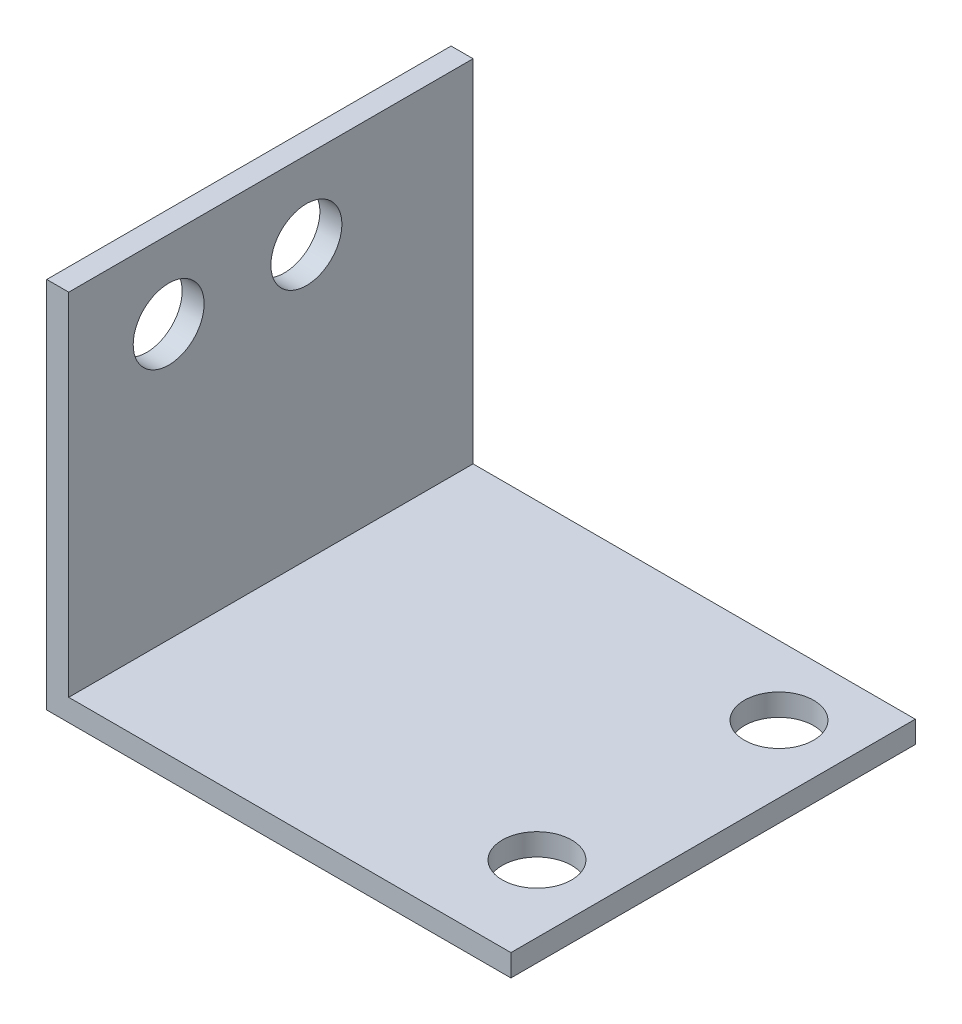
ISO-10303-21;
HEADER;
FILE_DESCRIPTION(('STEP AP214'),'2;1');
FILE_NAME('part.step','',(''),(''),'','','');
FILE_SCHEMA(('AUTOMOTIVE_DESIGN { 1 0 10303 214 1 1 1 1 }'));
ENDSEC;
DATA;
#1=APPLICATION_CONTEXT('core data for automotive mechanical design processes');
#2=APPLICATION_PROTOCOL_DEFINITION('international standard','automotive_design',2000,#1);
#3=PRODUCT_CONTEXT('',#1,'mechanical');
#4=PRODUCT('Part','Part','',(#3));
#5=PRODUCT_RELATED_PRODUCT_CATEGORY('part','',(#4));
#6=PRODUCT_DEFINITION_FORMATION('','',#4);
#7=PRODUCT_DEFINITION_CONTEXT('part definition',#1,'design');
#8=PRODUCT_DEFINITION('design','',#6,#7);
#9=PRODUCT_DEFINITION_SHAPE('','',#8);
#10=(LENGTH_UNIT() NAMED_UNIT(*) SI_UNIT(.MILLI.,.METRE.));
#11=(NAMED_UNIT(*) PLANE_ANGLE_UNIT() SI_UNIT($,.RADIAN.));
#12=(NAMED_UNIT(*) SI_UNIT($,.STERADIAN.) SOLID_ANGLE_UNIT());
#13=UNCERTAINTY_MEASURE_WITH_UNIT(LENGTH_MEASURE(1.E-05),#10,'distance_accuracy_value','');
#14=(GEOMETRIC_REPRESENTATION_CONTEXT(3) GLOBAL_UNCERTAINTY_ASSIGNED_CONTEXT((#13)) GLOBAL_UNIT_ASSIGNED_CONTEXT((#10,
#11,#12)) REPRESENTATION_CONTEXT('',''));
#15=CARTESIAN_POINT('',(0.,0.,0.));
#16=DIRECTION('',(0.,0.,1.));
#17=DIRECTION('',(1.,0.,0.));
#18=AXIS2_PLACEMENT_3D('',#15,#16,#17);
#19=CARTESIAN_POINT('',(0.,2.,0.));
#20=DIRECTION('',(0.,1.,0.));
#21=DIRECTION('',(0.,0.,1.));
#22=AXIS2_PLACEMENT_3D('',#19,#20,#21);
#23=PLANE('',#22);
#24=DIRECTION('',(0.,0.,-1.));
#25=VECTOR('',#24,1.);
#26=CARTESIAN_POINT('',(-19.1,2.,0.));
#27=LINE('',#26,#25);
#28=CARTESIAN_POINT('',(-19.1,2.,18.38));
#29=VERTEX_POINT('',#28);
#30=CARTESIAN_POINT('',(-19.1,2.,-18.38));
#31=VERTEX_POINT('',#30);
#32=EDGE_CURVE('E51',#29,#31,#27,.T.);
#33=ORIENTED_EDGE('',*,*,#32,.F.);
#34=DIRECTION('',(1.,0.,0.));
#35=VECTOR('',#34,1.);
#36=CARTESIAN_POINT('',(-21.1,2.,18.38));
#37=LINE('',#36,#35);
#38=CARTESIAN_POINT('',(21.1,2.,18.38));
#39=VERTEX_POINT('',#38);
#40=EDGE_CURVE('E90',#29,#39,#37,.T.);
#41=ORIENTED_EDGE('',*,*,#40,.T.);
#42=DIRECTION('',(0.,0.,-1.));
#43=VECTOR('',#42,1.);
#44=CARTESIAN_POINT('',(21.1,2.,-18.38));
#45=LINE('',#44,#43);
#46=CARTESIAN_POINT('',(21.1,2.,-18.38));
#47=VERTEX_POINT('',#46);
#48=EDGE_CURVE('E127',#39,#47,#45,.T.);
#49=ORIENTED_EDGE('',*,*,#48,.T.);
#50=DIRECTION('',(-1.,0.,0.));
#51=VECTOR('',#50,1.);
#52=CARTESIAN_POINT('',(-21.1,2.,-18.38));
#53=LINE('',#52,#51);
#54=EDGE_CURVE('E47',#47,#31,#53,.T.);
#55=ORIENTED_EDGE('',*,*,#54,.T.);
#56=EDGE_LOOP('',(#33,#41,#49,#55));
#57=FACE_BOUND('',#56,.T.);
#58=CARTESIAN_POINT('',(14.99,2.,-12.1));
#59=DIRECTION('',(0.,1.,0.));
#60=DIRECTION('',(0.,0.,1.));
#61=AXIS2_PLACEMENT_3D('',#58,#59,#60);
#62=CIRCLE('',#61,3.15);
#63=CARTESIAN_POINT('',(14.99,2.,-8.95));
#64=VERTEX_POINT('',#63);
#65=EDGE_CURVE('E121',#64,#64,#62,.T.);
#66=ORIENTED_EDGE('',*,*,#65,.F.);
#67=EDGE_LOOP('',(#66));
#68=FACE_BOUND('',#67,.T.);
#69=CARTESIAN_POINT('',(14.99,2.,9.9));
#70=DIRECTION('',(0.,1.,0.));
#71=DIRECTION('',(0.,0.,1.));
#72=AXIS2_PLACEMENT_3D('',#69,#70,#71);
#73=CIRCLE('',#72,3.15);
#74=CARTESIAN_POINT('',(14.99,2.,13.05));
#75=VERTEX_POINT('',#74);
#76=EDGE_CURVE('E115',#75,#75,#73,.T.);
#77=ORIENTED_EDGE('',*,*,#76,.F.);
#78=EDGE_LOOP('',(#77));
#79=FACE_BOUND('',#78,.T.);
#80=ADVANCED_FACE('F32',(#57,#68,#79),#23,.T.);
#81=CARTESIAN_POINT('',(0.,0.,0.));
#82=DIRECTION('',(0.,1.,0.));
#83=DIRECTION('',(0.,0.,1.));
#84=AXIS2_PLACEMENT_3D('',#81,#82,#83);
#85=PLANE('',#84);
#86=CARTESIAN_POINT('',(14.99,0.,-12.1));
#87=DIRECTION('',(0.,1.,0.));
#88=DIRECTION('',(0.,0.,1.));
#89=AXIS2_PLACEMENT_3D('',#86,#87,#88);
#90=CIRCLE('',#89,3.15);
#91=CARTESIAN_POINT('',(14.99,0.,-8.95));
#92=VERTEX_POINT('',#91);
#93=EDGE_CURVE('E118',#92,#92,#90,.T.);
#94=ORIENTED_EDGE('',*,*,#93,.T.);
#95=EDGE_LOOP('',(#94));
#96=FACE_BOUND('',#95,.T.);
#97=DIRECTION('',(0.,0.,-1.));
#98=VECTOR('',#97,1.);
#99=CARTESIAN_POINT('',(21.1,0.,-18.38));
#100=LINE('',#99,#98);
#101=CARTESIAN_POINT('',(21.1,0.,18.38));
#102=VERTEX_POINT('',#101);
#103=CARTESIAN_POINT('',(21.1,0.,-18.38));
#104=VERTEX_POINT('',#103);
#105=EDGE_CURVE('E124',#102,#104,#100,.T.);
#106=ORIENTED_EDGE('',*,*,#105,.F.);
#107=DIRECTION('',(1.,0.,0.));
#108=VECTOR('',#107,1.);
#109=CARTESIAN_POINT('',(-21.1,0.,18.38));
#110=LINE('',#109,#108);
#111=CARTESIAN_POINT('',(-21.1,0.,18.38));
#112=VERTEX_POINT('',#111);
#113=EDGE_CURVE('E129',#112,#102,#110,.T.);
#114=ORIENTED_EDGE('',*,*,#113,.F.);
#115=DIRECTION('',(0.,0.,1.));
#116=VECTOR('',#115,1.);
#117=CARTESIAN_POINT('',(-21.1,0.,-18.38));
#118=LINE('',#117,#116);
#119=CARTESIAN_POINT('',(-21.1,0.,-18.38));
#120=VERTEX_POINT('',#119);
#121=EDGE_CURVE('E137',#120,#112,#118,.T.);
#122=ORIENTED_EDGE('',*,*,#121,.F.);
#123=DIRECTION('',(-1.,0.,0.));
#124=VECTOR('',#123,1.);
#125=CARTESIAN_POINT('',(-21.1,0.,-18.38));
#126=LINE('',#125,#124);
#127=EDGE_CURVE('E135',#104,#120,#126,.T.);
#128=ORIENTED_EDGE('',*,*,#127,.F.);
#129=EDGE_LOOP('',(#106,#114,#122,#128));
#130=FACE_BOUND('',#129,.T.);
#131=CARTESIAN_POINT('',(14.99,0.,9.9));
#132=DIRECTION('',(0.,1.,0.));
#133=DIRECTION('',(0.,0.,1.));
#134=AXIS2_PLACEMENT_3D('',#131,#132,#133);
#135=CIRCLE('',#134,3.15);
#136=CARTESIAN_POINT('',(14.99,0.,13.05));
#137=VERTEX_POINT('',#136);
#138=EDGE_CURVE('E114',#137,#137,#135,.T.);
#139=ORIENTED_EDGE('',*,*,#138,.T.);
#140=EDGE_LOOP('',(#139));
#141=FACE_BOUND('',#140,.T.);
#142=ADVANCED_FACE('F152',(#96,#130,#141),#85,.F.);
#143=CARTESIAN_POINT('',(21.1,2.,-18.38));
#144=DIRECTION('',(-1.,0.,0.));
#145=DIRECTION('',(0.,0.,1.));
#146=AXIS2_PLACEMENT_3D('',#143,#144,#145);
#147=PLANE('',#146);
#148=ORIENTED_EDGE('',*,*,#105,.T.);
#149=DIRECTION('',(0.,-1.,0.));
#150=VECTOR('',#149,1.);
#151=CARTESIAN_POINT('',(21.1,2.,-18.38));
#152=LINE('',#151,#150);
#153=EDGE_CURVE('E11',#47,#104,#152,.T.);
#154=ORIENTED_EDGE('',*,*,#153,.F.);
#155=ORIENTED_EDGE('',*,*,#48,.F.);
#156=DIRECTION('',(0.,-1.,0.));
#157=VECTOR('',#156,1.);
#158=CARTESIAN_POINT('',(21.1,2.,18.38));
#159=LINE('',#158,#157);
#160=EDGE_CURVE('E132',#39,#102,#159,.T.);
#161=ORIENTED_EDGE('',*,*,#160,.T.);
#162=EDGE_LOOP('',(#148,#154,#155,#161));
#163=FACE_BOUND('',#162,.T.);
#164=ADVANCED_FACE('F34',(#163),#147,.F.);
#165=CARTESIAN_POINT('',(-21.1,2.,-18.38));
#166=DIRECTION('',(0.,0.,1.));
#167=DIRECTION('',(1.,0.,0.));
#168=AXIS2_PLACEMENT_3D('',#165,#166,#167);
#169=PLANE('',#168);
#170=ORIENTED_EDGE('',*,*,#127,.T.);
#171=DIRECTION('',(0.,-1.,0.));
#172=VECTOR('',#171,1.);
#173=CARTESIAN_POINT('',(-21.1,2.,-18.38));
#174=LINE('',#173,#172);
#175=CARTESIAN_POINT('',(-21.1,33.9,-18.38));
#176=VERTEX_POINT('',#175);
#177=EDGE_CURVE('E40',#176,#120,#174,.T.);
#178=ORIENTED_EDGE('',*,*,#177,.F.);
#179=DIRECTION('',(-1.,0.,0.));
#180=VECTOR('',#179,1.);
#181=CARTESIAN_POINT('',(-19.1,33.9,-18.38));
#182=LINE('',#181,#180);
#183=CARTESIAN_POINT('',(-19.1,33.9,-18.38));
#184=VERTEX_POINT('',#183);
#185=EDGE_CURVE('E102',#184,#176,#182,.T.);
#186=ORIENTED_EDGE('',*,*,#185,.F.);
#187=DIRECTION('',(0.,-1.,0.));
#188=VECTOR('',#187,1.);
#189=CARTESIAN_POINT('',(-19.1,0.,-18.38));
#190=LINE('',#189,#188);
#191=EDGE_CURVE('E94',#184,#31,#190,.T.);
#192=ORIENTED_EDGE('',*,*,#191,.T.);
#193=ORIENTED_EDGE('',*,*,#54,.F.);
#194=ORIENTED_EDGE('',*,*,#153,.T.);
#195=EDGE_LOOP('',(#170,#178,#186,#192,#193,#194));
#196=FACE_BOUND('',#195,.T.);
#197=ADVANCED_FACE('F176',(#196),#169,.F.);
#198=CARTESIAN_POINT('',(-21.1,2.,-18.38));
#199=DIRECTION('',(1.,0.,0.));
#200=DIRECTION('',(0.,0.,-1.));
#201=AXIS2_PLACEMENT_3D('',#198,#199,#200);
#202=PLANE('',#201);
#203=ORIENTED_EDGE('',*,*,#121,.T.);
#204=DIRECTION('',(0.,-1.,0.));
#205=VECTOR('',#204,1.);
#206=CARTESIAN_POINT('',(-21.1,2.,18.38));
#207=LINE('',#206,#205);
#208=CARTESIAN_POINT('',(-21.1,33.9,18.38));
#209=VERTEX_POINT('',#208);
#210=EDGE_CURVE('E142',#209,#112,#207,.T.);
#211=ORIENTED_EDGE('',*,*,#210,.F.);
#212=DIRECTION('',(0.,0.,-1.));
#213=VECTOR('',#212,1.);
#214=CARTESIAN_POINT('',(-21.1,33.9,-18.38));
#215=LINE('',#214,#213);
#216=EDGE_CURVE('E101',#209,#176,#215,.T.);
#217=ORIENTED_EDGE('',*,*,#216,.T.);
#218=ORIENTED_EDGE('',*,*,#177,.T.);
#219=EDGE_LOOP('',(#203,#211,#217,#218));
#220=FACE_BOUND('',#219,.T.);
#221=CARTESIAN_POINT('',(-21.1,26.835,9.29499999999999));
#222=DIRECTION('',(-1.,0.,0.));
#223=DIRECTION('',(0.,0.,1.));
#224=AXIS2_PLACEMENT_3D('',#221,#222,#223);
#225=CIRCLE('',#224,3.225);
#226=CARTESIAN_POINT('',(-21.1,26.835,12.52));
#227=VERTEX_POINT('',#226);
#228=EDGE_CURVE('E192',#227,#227,#225,.T.);
#229=ORIENTED_EDGE('',*,*,#228,.F.);
#230=EDGE_LOOP('',(#229));
#231=FACE_BOUND('',#230,.T.);
#232=CARTESIAN_POINT('',(-21.1,26.835,-3.225));
#233=DIRECTION('',(-1.,0.,0.));
#234=DIRECTION('',(0.,0.,1.));
#235=AXIS2_PLACEMENT_3D('',#232,#233,#234);
#236=CIRCLE('',#235,3.225);
#237=CARTESIAN_POINT('',(-21.1,26.835,0.));
#238=VERTEX_POINT('',#237);
#239=EDGE_CURVE('E186',#238,#238,#236,.T.);
#240=ORIENTED_EDGE('',*,*,#239,.F.);
#241=EDGE_LOOP('',(#240));
#242=FACE_BOUND('',#241,.T.);
#243=ADVANCED_FACE('F146',(#220,#231,#242),#202,.F.);
#244=CARTESIAN_POINT('',(-21.1,2.,18.38));
#245=DIRECTION('',(0.,0.,-1.));
#246=DIRECTION('',(-1.,0.,0.));
#247=AXIS2_PLACEMENT_3D('',#244,#245,#246);
#248=PLANE('',#247);
#249=ORIENTED_EDGE('',*,*,#40,.F.);
#250=DIRECTION('',(0.,1.,0.));
#251=VECTOR('',#250,1.);
#252=CARTESIAN_POINT('',(-19.1,0.,18.38));
#253=LINE('',#252,#251);
#254=CARTESIAN_POINT('',(-19.1,33.9,18.38));
#255=VERTEX_POINT('',#254);
#256=EDGE_CURVE('E83',#29,#255,#253,.T.);
#257=ORIENTED_EDGE('',*,*,#256,.T.);
#258=DIRECTION('',(-1.,0.,0.));
#259=VECTOR('',#258,1.);
#260=CARTESIAN_POINT('',(-19.1,33.9,18.38));
#261=LINE('',#260,#259);
#262=EDGE_CURVE('E87',#255,#209,#261,.T.);
#263=ORIENTED_EDGE('',*,*,#262,.T.);
#264=ORIENTED_EDGE('',*,*,#210,.T.);
#265=ORIENTED_EDGE('',*,*,#113,.T.);
#266=ORIENTED_EDGE('',*,*,#160,.F.);
#267=EDGE_LOOP('',(#249,#257,#263,#264,#265,#266));
#268=FACE_BOUND('',#267,.T.);
#269=ADVANCED_FACE('F85',(#268),#248,.F.);
#270=CARTESIAN_POINT('',(14.99,2.,-12.1));
#271=DIRECTION('',(0.,-1.,0.));
#272=DIRECTION('',(0.,0.,-1.));
#273=AXIS2_PLACEMENT_3D('',#270,#271,#272);
#274=CYLINDRICAL_SURFACE('',#273,3.15);
#275=ORIENTED_EDGE('',*,*,#65,.T.);
#276=EDGE_LOOP('',(#275));
#277=FACE_BOUND('',#276,.T.);
#278=ORIENTED_EDGE('',*,*,#93,.F.);
#279=EDGE_LOOP('',(#278));
#280=FACE_BOUND('',#279,.T.);
#281=ADVANCED_FACE('F167',(#277,#280),#274,.F.);
#282=CARTESIAN_POINT('',(14.99,2.,9.9));
#283=DIRECTION('',(0.,-1.,0.));
#284=DIRECTION('',(0.,0.,-1.));
#285=AXIS2_PLACEMENT_3D('',#282,#283,#284);
#286=CYLINDRICAL_SURFACE('',#285,3.15);
#287=ORIENTED_EDGE('',*,*,#76,.T.);
#288=EDGE_LOOP('',(#287));
#289=FACE_BOUND('',#288,.T.);
#290=ORIENTED_EDGE('',*,*,#138,.F.);
#291=EDGE_LOOP('',(#290));
#292=FACE_BOUND('',#291,.T.);
#293=ADVANCED_FACE('F164',(#289,#292),#286,.F.);
#294=CARTESIAN_POINT('',(-19.1,33.9,-18.38));
#295=DIRECTION('',(0.,1.,0.));
#296=DIRECTION('',(0.,0.,1.));
#297=AXIS2_PLACEMENT_3D('',#294,#295,#296);
#298=PLANE('',#297);
#299=ORIENTED_EDGE('',*,*,#216,.F.);
#300=ORIENTED_EDGE('',*,*,#262,.F.);
#301=DIRECTION('',(0.,0.,-1.));
#302=VECTOR('',#301,1.);
#303=CARTESIAN_POINT('',(-19.1,33.9,-18.38));
#304=LINE('',#303,#302);
#305=EDGE_CURVE('E93',#255,#184,#304,.T.);
#306=ORIENTED_EDGE('',*,*,#305,.T.);
#307=ORIENTED_EDGE('',*,*,#185,.T.);
#308=EDGE_LOOP('',(#299,#300,#306,#307));
#309=FACE_BOUND('',#308,.T.);
#310=ADVANCED_FACE('F98',(#309),#298,.T.);
#311=CARTESIAN_POINT('',(-19.1,0.,0.));
#312=DIRECTION('',(1.,0.,0.));
#313=DIRECTION('',(0.,0.,-1.));
#314=AXIS2_PLACEMENT_3D('',#311,#312,#313);
#315=PLANE('',#314);
#316=CARTESIAN_POINT('',(-19.1,26.835,9.29499999999999));
#317=DIRECTION('',(-1.,0.,0.));
#318=DIRECTION('',(0.,0.,1.));
#319=AXIS2_PLACEMENT_3D('',#316,#317,#318);
#320=CIRCLE('',#319,3.225);
#321=CARTESIAN_POINT('',(-19.1,26.835,12.52));
#322=VERTEX_POINT('',#321);
#323=EDGE_CURVE('E189',#322,#322,#320,.T.);
#324=ORIENTED_EDGE('',*,*,#323,.T.);
#325=EDGE_LOOP('',(#324));
#326=FACE_BOUND('',#325,.T.);
#327=CARTESIAN_POINT('',(-19.1,26.835,-3.225));
#328=DIRECTION('',(-1.,0.,0.));
#329=DIRECTION('',(0.,0.,1.));
#330=AXIS2_PLACEMENT_3D('',#327,#328,#329);
#331=CIRCLE('',#330,3.225);
#332=CARTESIAN_POINT('',(-19.1,26.835,0.));
#333=VERTEX_POINT('',#332);
#334=EDGE_CURVE('E111',#333,#333,#331,.T.);
#335=ORIENTED_EDGE('',*,*,#334,.T.);
#336=EDGE_LOOP('',(#335));
#337=FACE_BOUND('',#336,.T.);
#338=ORIENTED_EDGE('',*,*,#256,.F.);
#339=ORIENTED_EDGE('',*,*,#32,.T.);
#340=ORIENTED_EDGE('',*,*,#191,.F.);
#341=ORIENTED_EDGE('',*,*,#305,.F.);
#342=EDGE_LOOP('',(#338,#339,#340,#341));
#343=FACE_BOUND('',#342,.T.);
#344=ADVANCED_FACE('F105',(#326,#337,#343),#315,.T.);
#345=CARTESIAN_POINT('',(-19.1,26.835,-3.225));
#346=DIRECTION('',(-1.,0.,0.));
#347=DIRECTION('',(0.,0.,1.));
#348=AXIS2_PLACEMENT_3D('',#345,#346,#347);
#349=CYLINDRICAL_SURFACE('',#348,3.225);
#350=ORIENTED_EDGE('',*,*,#334,.F.);
#351=EDGE_LOOP('',(#350));
#352=FACE_BOUND('',#351,.T.);
#353=ORIENTED_EDGE('',*,*,#239,.T.);
#354=EDGE_LOOP('',(#353));
#355=FACE_BOUND('',#354,.T.);
#356=ADVANCED_FACE('F203',(#352,#355),#349,.F.);
#357=CARTESIAN_POINT('',(-19.1,26.835,9.29499999999999));
#358=DIRECTION('',(-1.,0.,0.));
#359=DIRECTION('',(0.,0.,1.));
#360=AXIS2_PLACEMENT_3D('',#357,#358,#359);
#361=CYLINDRICAL_SURFACE('',#360,3.225);
#362=ORIENTED_EDGE('',*,*,#323,.F.);
#363=EDGE_LOOP('',(#362));
#364=FACE_BOUND('',#363,.T.);
#365=ORIENTED_EDGE('',*,*,#228,.T.);
#366=EDGE_LOOP('',(#365));
#367=FACE_BOUND('',#366,.T.);
#368=ADVANCED_FACE('F200',(#364,#367),#361,.F.);
#369=CLOSED_SHELL('',(#80,#142,#164,#197,#243,#269,#281,#293,#310,#344,#356,#368));
#370=MANIFOLD_SOLID_BREP('B2',#369);
#371=ADVANCED_BREP_SHAPE_REPRESENTATION('',(#18,#370),#14);
#372=SHAPE_DEFINITION_REPRESENTATION(#9,#371);
ENDSEC;
END-ISO-10303-21;
